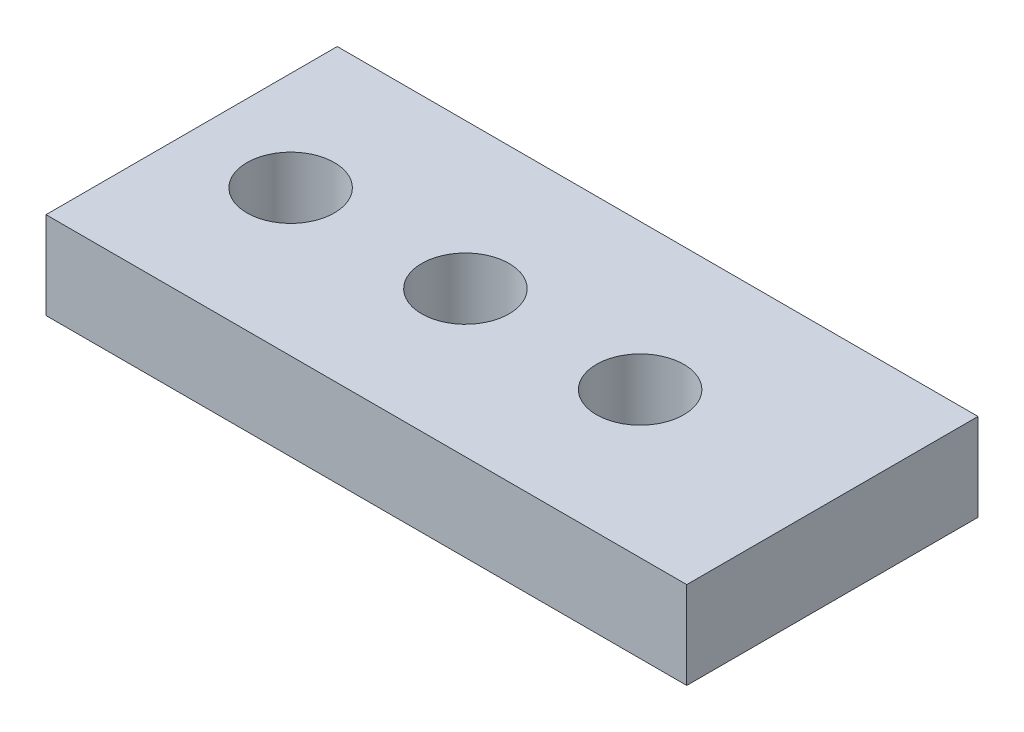
ISO-10303-21;
HEADER;
FILE_DESCRIPTION(('STEP AP214'),'2;1');
FILE_NAME('part.step','',(''),(''),'','','');
FILE_SCHEMA(('AUTOMOTIVE_DESIGN { 1 0 10303 214 1 1 1 1 }'));
ENDSEC;
DATA;
#1=APPLICATION_CONTEXT('core data for automotive mechanical design processes');
#2=APPLICATION_PROTOCOL_DEFINITION('international standard','automotive_design',2000,#1);
#3=PRODUCT_CONTEXT('',#1,'mechanical');
#4=PRODUCT('Part','Part','',(#3));
#5=PRODUCT_RELATED_PRODUCT_CATEGORY('part','',(#4));
#6=PRODUCT_DEFINITION_FORMATION('','',#4);
#7=PRODUCT_DEFINITION_CONTEXT('part definition',#1,'design');
#8=PRODUCT_DEFINITION('design','',#6,#7);
#9=PRODUCT_DEFINITION_SHAPE('','',#8);
#10=(LENGTH_UNIT() NAMED_UNIT(*) SI_UNIT(.MILLI.,.METRE.));
#11=(NAMED_UNIT(*) PLANE_ANGLE_UNIT() SI_UNIT($,.RADIAN.));
#12=(NAMED_UNIT(*) SI_UNIT($,.STERADIAN.) SOLID_ANGLE_UNIT());
#13=UNCERTAINTY_MEASURE_WITH_UNIT(LENGTH_MEASURE(1.E-05),#10,'distance_accuracy_value','');
#14=(GEOMETRIC_REPRESENTATION_CONTEXT(3) GLOBAL_UNCERTAINTY_ASSIGNED_CONTEXT((#13)) GLOBAL_UNIT_ASSIGNED_CONTEXT((#10,
#11,#12)) REPRESENTATION_CONTEXT('',''));
#15=CARTESIAN_POINT('',(0.,0.,0.));
#16=DIRECTION('',(0.,0.,1.));
#17=DIRECTION('',(1.,0.,0.));
#18=AXIS2_PLACEMENT_3D('',#15,#16,#17);
#19=CARTESIAN_POINT('',(-55.,-15.,25.));
#20=DIRECTION('',(-1.,0.,0.));
#21=DIRECTION('',(0.,0.,1.));
#22=AXIS2_PLACEMENT_3D('',#19,#20,#21);
#23=PLANE('',#22);
#24=DIRECTION('',(0.,0.,1.));
#25=VECTOR('',#24,1.);
#26=CARTESIAN_POINT('',(-55.,0.,25.));
#27=LINE('',#26,#25);
#28=CARTESIAN_POINT('',(-55.,0.,-25.));
#29=VERTEX_POINT('',#28);
#30=CARTESIAN_POINT('',(-55.,0.,25.));
#31=VERTEX_POINT('',#30);
#32=EDGE_CURVE('E103',#29,#31,#27,.T.);
#33=ORIENTED_EDGE('',*,*,#32,.F.);
#34=DIRECTION('',(0.,1.,0.));
#35=VECTOR('',#34,1.);
#36=CARTESIAN_POINT('',(-55.,-15.,-25.));
#37=LINE('',#36,#35);
#38=CARTESIAN_POINT('',(-55.,-15.,-25.));
#39=VERTEX_POINT('',#38);
#40=EDGE_CURVE('E11',#39,#29,#37,.T.);
#41=ORIENTED_EDGE('',*,*,#40,.F.);
#42=DIRECTION('',(0.,0.,1.));
#43=VECTOR('',#42,1.);
#44=CARTESIAN_POINT('',(-55.,-15.,25.));
#45=LINE('',#44,#43);
#46=CARTESIAN_POINT('',(-55.,-15.,25.));
#47=VERTEX_POINT('',#46);
#48=EDGE_CURVE('E96',#39,#47,#45,.T.);
#49=ORIENTED_EDGE('',*,*,#48,.T.);
#50=DIRECTION('',(0.,1.,0.));
#51=VECTOR('',#50,1.);
#52=CARTESIAN_POINT('',(-55.,-15.,25.));
#53=LINE('',#52,#51);
#54=EDGE_CURVE('E41',#47,#31,#53,.T.);
#55=ORIENTED_EDGE('',*,*,#54,.T.);
#56=EDGE_LOOP('',(#33,#41,#49,#55));
#57=FACE_BOUND('',#56,.T.);
#58=ADVANCED_FACE('F38',(#57),#23,.T.);
#59=CARTESIAN_POINT('',(55.,-15.,-25.));
#60=DIRECTION('',(0.,0.,-1.));
#61=DIRECTION('',(-1.,0.,0.));
#62=AXIS2_PLACEMENT_3D('',#59,#60,#61);
#63=PLANE('',#62);
#64=DIRECTION('',(-1.,0.,0.));
#65=VECTOR('',#64,1.);
#66=CARTESIAN_POINT('',(55.,0.,-25.));
#67=LINE('',#66,#65);
#68=CARTESIAN_POINT('',(55.,0.,-25.));
#69=VERTEX_POINT('',#68);
#70=EDGE_CURVE('E98',#69,#29,#67,.T.);
#71=ORIENTED_EDGE('',*,*,#70,.F.);
#72=DIRECTION('',(0.,1.,0.));
#73=VECTOR('',#72,1.);
#74=CARTESIAN_POINT('',(55.,-15.,-25.));
#75=LINE('',#74,#73);
#76=CARTESIAN_POINT('',(55.,-15.,-25.));
#77=VERTEX_POINT('',#76);
#78=EDGE_CURVE('E47',#77,#69,#75,.T.);
#79=ORIENTED_EDGE('',*,*,#78,.F.);
#80=DIRECTION('',(-1.,0.,0.));
#81=VECTOR('',#80,1.);
#82=CARTESIAN_POINT('',(55.,-15.,-25.));
#83=LINE('',#82,#81);
#84=EDGE_CURVE('E93',#77,#39,#83,.T.);
#85=ORIENTED_EDGE('',*,*,#84,.T.);
#86=ORIENTED_EDGE('',*,*,#40,.T.);
#87=EDGE_LOOP('',(#71,#79,#85,#86));
#88=FACE_BOUND('',#87,.T.);
#89=ADVANCED_FACE('F114',(#88),#63,.T.);
#90=CARTESIAN_POINT('',(55.,-15.,25.));
#91=DIRECTION('',(1.,0.,0.));
#92=DIRECTION('',(0.,0.,-1.));
#93=AXIS2_PLACEMENT_3D('',#90,#91,#92);
#94=PLANE('',#93);
#95=DIRECTION('',(0.,0.,-1.));
#96=VECTOR('',#95,1.);
#97=CARTESIAN_POINT('',(55.,0.,25.));
#98=LINE('',#97,#96);
#99=CARTESIAN_POINT('',(55.,0.,25.));
#100=VERTEX_POINT('',#99);
#101=EDGE_CURVE('E88',#100,#69,#98,.T.);
#102=ORIENTED_EDGE('',*,*,#101,.F.);
#103=DIRECTION('',(0.,1.,0.));
#104=VECTOR('',#103,1.);
#105=CARTESIAN_POINT('',(55.,-15.,25.));
#106=LINE('',#105,#104);
#107=CARTESIAN_POINT('',(55.,-15.,25.));
#108=VERTEX_POINT('',#107);
#109=EDGE_CURVE('E83',#108,#100,#106,.T.);
#110=ORIENTED_EDGE('',*,*,#109,.F.);
#111=DIRECTION('',(0.,0.,-1.));
#112=VECTOR('',#111,1.);
#113=CARTESIAN_POINT('',(55.,-15.,25.));
#114=LINE('',#113,#112);
#115=EDGE_CURVE('E86',#108,#77,#114,.T.);
#116=ORIENTED_EDGE('',*,*,#115,.T.);
#117=ORIENTED_EDGE('',*,*,#78,.T.);
#118=EDGE_LOOP('',(#102,#110,#116,#117));
#119=FACE_BOUND('',#118,.T.);
#120=ADVANCED_FACE('F85',(#119),#94,.T.);
#121=CARTESIAN_POINT('',(55.,-15.,25.));
#122=DIRECTION('',(0.,0.,1.));
#123=DIRECTION('',(1.,0.,0.));
#124=AXIS2_PLACEMENT_3D('',#121,#122,#123);
#125=PLANE('',#124);
#126=DIRECTION('',(1.,0.,0.));
#127=VECTOR('',#126,1.);
#128=CARTESIAN_POINT('',(55.,0.,25.));
#129=LINE('',#128,#127);
#130=EDGE_CURVE('E106',#31,#100,#129,.T.);
#131=ORIENTED_EDGE('',*,*,#130,.F.);
#132=ORIENTED_EDGE('',*,*,#54,.F.);
#133=DIRECTION('',(1.,0.,0.));
#134=VECTOR('',#133,1.);
#135=CARTESIAN_POINT('',(55.,-15.,25.));
#136=LINE('',#135,#134);
#137=EDGE_CURVE('E92',#47,#108,#136,.T.);
#138=ORIENTED_EDGE('',*,*,#137,.T.);
#139=ORIENTED_EDGE('',*,*,#109,.T.);
#140=EDGE_LOOP('',(#131,#132,#138,#139));
#141=FACE_BOUND('',#140,.T.);
#142=ADVANCED_FACE('F95',(#141),#125,.T.);
#143=CARTESIAN_POINT('',(0.,-15.,0.));
#144=DIRECTION('',(0.,1.,0.));
#145=DIRECTION('',(0.,0.,1.));
#146=AXIS2_PLACEMENT_3D('',#143,#144,#145);
#147=PLANE('',#146);
#148=CARTESIAN_POINT('',(22.,-15.,0.));
#149=DIRECTION('',(0.,1.,0.));
#150=DIRECTION('',(0.,0.,1.));
#151=AXIS2_PLACEMENT_3D('',#148,#149,#150);
#152=CIRCLE('',#151,7.5);
#153=CARTESIAN_POINT('',(22.,-15.,7.49999999999994));
#154=VERTEX_POINT('',#153);
#155=EDGE_CURVE('E151',#154,#154,#152,.T.);
#156=ORIENTED_EDGE('',*,*,#155,.T.);
#157=EDGE_LOOP('',(#156));
#158=FACE_BOUND('',#157,.T.);
#159=CARTESIAN_POINT('',(-8.00000000000001,-15.,0.));
#160=DIRECTION('',(0.,1.,0.));
#161=DIRECTION('',(0.,0.,1.));
#162=AXIS2_PLACEMENT_3D('',#159,#160,#161);
#163=CIRCLE('',#162,7.5);
#164=CARTESIAN_POINT('',(-8.00000000000001,-15.,7.5));
#165=VERTEX_POINT('',#164);
#166=EDGE_CURVE('E159',#165,#165,#163,.T.);
#167=ORIENTED_EDGE('',*,*,#166,.T.);
#168=EDGE_LOOP('',(#167));
#169=FACE_BOUND('',#168,.T.);
#170=CARTESIAN_POINT('',(-38.,-15.,0.));
#171=DIRECTION('',(0.,1.,0.));
#172=DIRECTION('',(0.,0.,1.));
#173=AXIS2_PLACEMENT_3D('',#170,#171,#172);
#174=CIRCLE('',#173,7.5);
#175=CARTESIAN_POINT('',(-38.,-15.,7.49999999999994));
#176=VERTEX_POINT('',#175);
#177=EDGE_CURVE('E107',#176,#176,#174,.T.);
#178=ORIENTED_EDGE('',*,*,#177,.T.);
#179=EDGE_LOOP('',(#178));
#180=FACE_BOUND('',#179,.T.);
#181=ORIENTED_EDGE('',*,*,#48,.F.);
#182=ORIENTED_EDGE('',*,*,#84,.F.);
#183=ORIENTED_EDGE('',*,*,#115,.F.);
#184=ORIENTED_EDGE('',*,*,#137,.F.);
#185=EDGE_LOOP('',(#181,#182,#183,#184));
#186=FACE_BOUND('',#185,.T.);
#187=ADVANCED_FACE('F91',(#158,#169,#180,#186),#147,.F.);
#188=CARTESIAN_POINT('',(0.,0.,0.));
#189=DIRECTION('',(0.,1.,0.));
#190=DIRECTION('',(0.,0.,1.));
#191=AXIS2_PLACEMENT_3D('',#188,#189,#190);
#192=PLANE('',#191);
#193=CARTESIAN_POINT('',(22.,0.,0.));
#194=DIRECTION('',(0.,1.,0.));
#195=DIRECTION('',(0.,0.,1.));
#196=AXIS2_PLACEMENT_3D('',#193,#194,#195);
#197=CIRCLE('',#196,7.5);
#198=CARTESIAN_POINT('',(22.,0.,7.49999999999994));
#199=VERTEX_POINT('',#198);
#200=EDGE_CURVE('E154',#199,#199,#197,.T.);
#201=ORIENTED_EDGE('',*,*,#200,.F.);
#202=EDGE_LOOP('',(#201));
#203=FACE_BOUND('',#202,.T.);
#204=CARTESIAN_POINT('',(-8.00000000000001,0.,0.));
#205=DIRECTION('',(0.,1.,0.));
#206=DIRECTION('',(0.,0.,1.));
#207=AXIS2_PLACEMENT_3D('',#204,#205,#206);
#208=CIRCLE('',#207,7.5);
#209=CARTESIAN_POINT('',(-8.00000000000001,0.,7.5));
#210=VERTEX_POINT('',#209);
#211=EDGE_CURVE('E156',#210,#210,#208,.T.);
#212=ORIENTED_EDGE('',*,*,#211,.F.);
#213=EDGE_LOOP('',(#212));
#214=FACE_BOUND('',#213,.T.);
#215=CARTESIAN_POINT('',(-38.,0.,0.));
#216=DIRECTION('',(0.,1.,0.));
#217=DIRECTION('',(0.,0.,1.));
#218=AXIS2_PLACEMENT_3D('',#215,#216,#217);
#219=CIRCLE('',#218,7.5);
#220=CARTESIAN_POINT('',(-38.,0.,7.49999999999994));
#221=VERTEX_POINT('',#220);
#222=EDGE_CURVE('E162',#221,#221,#219,.T.);
#223=ORIENTED_EDGE('',*,*,#222,.F.);
#224=EDGE_LOOP('',(#223));
#225=FACE_BOUND('',#224,.T.);
#226=ORIENTED_EDGE('',*,*,#32,.T.);
#227=ORIENTED_EDGE('',*,*,#130,.T.);
#228=ORIENTED_EDGE('',*,*,#101,.T.);
#229=ORIENTED_EDGE('',*,*,#70,.T.);
#230=EDGE_LOOP('',(#226,#227,#228,#229));
#231=FACE_BOUND('',#230,.T.);
#232=ADVANCED_FACE('F113',(#203,#214,#225,#231),#192,.T.);
#233=CARTESIAN_POINT('',(-38.,-15.,0.));
#234=DIRECTION('',(0.,1.,0.));
#235=DIRECTION('',(0.,0.,1.));
#236=AXIS2_PLACEMENT_3D('',#233,#234,#235);
#237=CYLINDRICAL_SURFACE('',#236,7.5);
#238=ORIENTED_EDGE('',*,*,#177,.F.);
#239=EDGE_LOOP('',(#238));
#240=FACE_BOUND('',#239,.T.);
#241=ORIENTED_EDGE('',*,*,#222,.T.);
#242=EDGE_LOOP('',(#241));
#243=FACE_BOUND('',#242,.T.);
#244=ADVANCED_FACE('F132',(#240,#243),#237,.F.);
#245=CARTESIAN_POINT('',(-8.00000000000001,-15.,0.));
#246=DIRECTION('',(0.,1.,0.));
#247=DIRECTION('',(0.,0.,1.));
#248=AXIS2_PLACEMENT_3D('',#245,#246,#247);
#249=CYLINDRICAL_SURFACE('',#248,7.5);
#250=ORIENTED_EDGE('',*,*,#166,.F.);
#251=EDGE_LOOP('',(#250));
#252=FACE_BOUND('',#251,.T.);
#253=ORIENTED_EDGE('',*,*,#211,.T.);
#254=EDGE_LOOP('',(#253));
#255=FACE_BOUND('',#254,.T.);
#256=ADVANCED_FACE('F139',(#252,#255),#249,.F.);
#257=CARTESIAN_POINT('',(22.,-15.,0.));
#258=DIRECTION('',(0.,1.,0.));
#259=DIRECTION('',(0.,0.,1.));
#260=AXIS2_PLACEMENT_3D('',#257,#258,#259);
#261=CYLINDRICAL_SURFACE('',#260,7.5);
#262=ORIENTED_EDGE('',*,*,#155,.F.);
#263=EDGE_LOOP('',(#262));
#264=FACE_BOUND('',#263,.T.);
#265=ORIENTED_EDGE('',*,*,#200,.T.);
#266=EDGE_LOOP('',(#265));
#267=FACE_BOUND('',#266,.T.);
#268=ADVANCED_FACE('F143',(#264,#267),#261,.F.);
#269=CLOSED_SHELL('',(#58,#89,#120,#142,#187,#232,#244,#256,#268));
#270=MANIFOLD_SOLID_BREP('B2',#269);
#271=ADVANCED_BREP_SHAPE_REPRESENTATION('',(#18,#270),#14);
#272=SHAPE_DEFINITION_REPRESENTATION(#9,#271);
ENDSEC;
END-ISO-10303-21;
